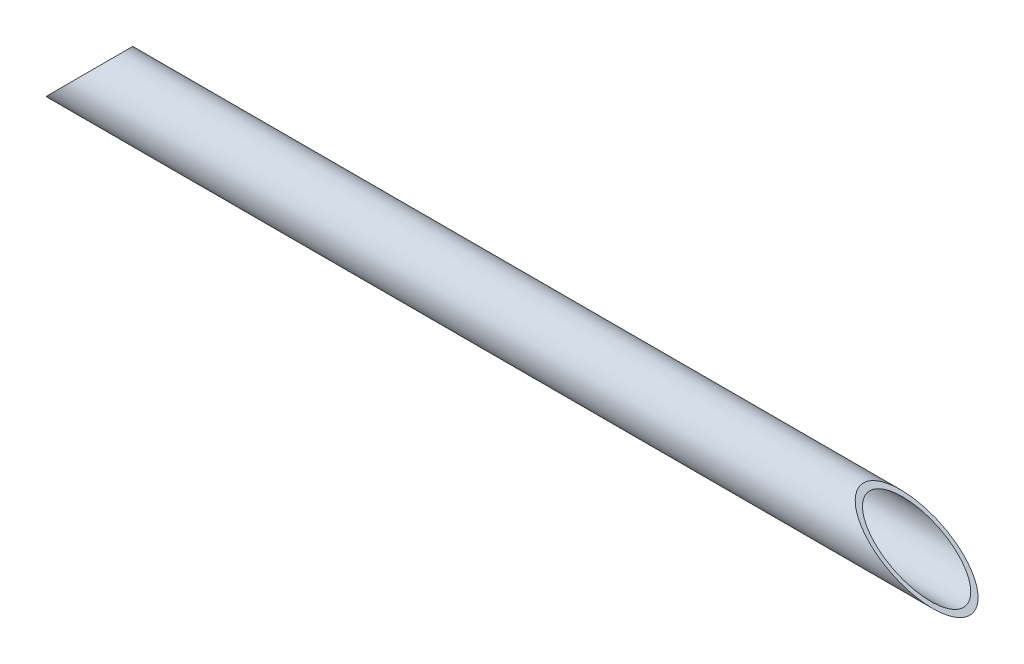
ISO-10303-21;
HEADER;
FILE_DESCRIPTION(('STEP AP214'),'2;1');
FILE_NAME('part.step','',(''),(''),'','','');
FILE_SCHEMA(('AUTOMOTIVE_DESIGN { 1 0 10303 214 1 1 1 1 }'));
ENDSEC;
DATA;
#1=APPLICATION_CONTEXT('core data for automotive mechanical design processes');
#2=APPLICATION_PROTOCOL_DEFINITION('international standard','automotive_design',2000,#1);
#3=PRODUCT_CONTEXT('',#1,'mechanical');
#4=PRODUCT('Part','Part','',(#3));
#5=PRODUCT_RELATED_PRODUCT_CATEGORY('part','',(#4));
#6=PRODUCT_DEFINITION_FORMATION('','',#4);
#7=PRODUCT_DEFINITION_CONTEXT('part definition',#1,'design');
#8=PRODUCT_DEFINITION('design','',#6,#7);
#9=PRODUCT_DEFINITION_SHAPE('','',#8);
#10=(LENGTH_UNIT() NAMED_UNIT(*) SI_UNIT(.MILLI.,.METRE.));
#11=(NAMED_UNIT(*) PLANE_ANGLE_UNIT() SI_UNIT($,.RADIAN.));
#12=(NAMED_UNIT(*) SI_UNIT($,.STERADIAN.) SOLID_ANGLE_UNIT());
#13=UNCERTAINTY_MEASURE_WITH_UNIT(LENGTH_MEASURE(1.E-05),#10,'distance_accuracy_value','');
#14=(GEOMETRIC_REPRESENTATION_CONTEXT(3) GLOBAL_UNCERTAINTY_ASSIGNED_CONTEXT((#13)) GLOBAL_UNIT_ASSIGNED_CONTEXT((#10,
#11,#12)) REPRESENTATION_CONTEXT('',''));
#15=CARTESIAN_POINT('',(0.,0.,0.));
#16=DIRECTION('',(0.,0.,1.));
#17=DIRECTION('',(1.,0.,0.));
#18=AXIS2_PLACEMENT_3D('',#15,#16,#17);
#19=CARTESIAN_POINT('',(287.299183666122,105.952873567218,646.395305171886));
#20=DIRECTION('',(0.500000000000001,0.866025403784438,0.));
#21=DIRECTION('',(-0.866025403784438,0.500000000000001,0.));
#22=AXIS2_PLACEMENT_3D('',#19,#20,#21);
#23=PLANE('',#22);
#24=CARTESIAN_POINT('',(470.814943892464,0.,0.));
#25=DIRECTION('',(0.500000000000001,0.866025403784438,0.));
#26=DIRECTION('',(-0.866025403784438,0.500000000000001,0.));
#27=AXIS2_PLACEMENT_3D('',#24,#25,#26);
#28=ELLIPSE('',#27,29.6999999999999,14.85);
#29=CARTESIAN_POINT('',(445.093989400067,14.85,0.));
#30=VERTEX_POINT('',#29);
#31=EDGE_CURVE('E60',#30,#30,#28,.T.);
#32=ORIENTED_EDGE('',*,*,#31,.F.);
#33=EDGE_LOOP('',(#32));
#34=FACE_BOUND('',#33,.T.);
#35=CARTESIAN_POINT('',(470.814943892464,0.,0.));
#36=DIRECTION('',(0.500000000000001,0.866025403784438,0.));
#37=DIRECTION('',(-0.866025403784438,0.500000000000001,0.));
#38=AXIS2_PLACEMENT_3D('',#35,#36,#37);
#39=ELLIPSE('',#38,33.6999999999999,16.85);
#40=CARTESIAN_POINT('',(441.629887784929,16.85,0.));
#41=VERTEX_POINT('',#40);
#42=EDGE_CURVE('E64',#41,#41,#39,.T.);
#43=ORIENTED_EDGE('',*,*,#42,.T.);
#44=EDGE_LOOP('',(#43));
#45=FACE_BOUND('',#44,.T.);
#46=ADVANCED_FACE('F56',(#34,#45),#23,.T.);
#47=CARTESIAN_POINT('',(500.,0.,0.));
#48=DIRECTION('',(-1.,0.,0.));
#49=DIRECTION('',(0.,0.,1.));
#50=AXIS2_PLACEMENT_3D('',#47,#48,#49);
#51=CYLINDRICAL_SURFACE('',#50,16.85);
#52=ORIENTED_EDGE('',*,*,#42,.F.);
#53=EDGE_LOOP('',(#52));
#54=FACE_BOUND('',#53,.T.);
#55=CARTESIAN_POINT('',(16.8499999999999,0.,0.));
#56=DIRECTION('',(-0.707106781186549,0.707106781186546,0.));
#57=DIRECTION('',(-0.707106781186546,-0.707106781186549,0.));
#58=AXIS2_PLACEMENT_3D('',#55,#56,#57);
#59=ELLIPSE('',#58,23.8294985259866,16.85);
#60=CARTESIAN_POINT('',(0.,-16.85,0.));
#61=VERTEX_POINT('',#60);
#62=EDGE_CURVE('E13',#61,#61,#59,.T.);
#63=ORIENTED_EDGE('',*,*,#62,.F.);
#64=EDGE_LOOP('',(#63));
#65=FACE_BOUND('',#64,.T.);
#66=ADVANCED_FACE('F80',(#54,#65),#51,.T.);
#67=CARTESIAN_POINT('',(0.,-16.85,646.395305171886));
#68=DIRECTION('',(-0.707106781186549,0.707106781186546,0.));
#69=DIRECTION('',(-0.707106781186546,-0.707106781186549,0.));
#70=AXIS2_PLACEMENT_3D('',#67,#68,#69);
#71=PLANE('',#70);
#72=CARTESIAN_POINT('',(16.8499999999999,0.,0.));
#73=DIRECTION('',(-0.707106781186549,0.707106781186546,0.));
#74=DIRECTION('',(-0.707106781186546,-0.707106781186549,0.));
#75=AXIS2_PLACEMENT_3D('',#72,#73,#74);
#76=ELLIPSE('',#75,21.0010714012404,14.85);
#77=CARTESIAN_POINT('',(1.99999999999998,-14.85,0.));
#78=VERTEX_POINT('',#77);
#79=EDGE_CURVE('E70',#78,#78,#76,.T.);
#80=ORIENTED_EDGE('',*,*,#79,.F.);
#81=EDGE_LOOP('',(#80));
#82=FACE_BOUND('',#81,.T.);
#83=ORIENTED_EDGE('',*,*,#62,.T.);
#84=EDGE_LOOP('',(#83));
#85=FACE_BOUND('',#84,.T.);
#86=ADVANCED_FACE('F86',(#82,#85),#71,.T.);
#87=CARTESIAN_POINT('',(500.,0.,0.));
#88=DIRECTION('',(-1.,0.,0.));
#89=DIRECTION('',(0.,0.,1.));
#90=AXIS2_PLACEMENT_3D('',#87,#88,#89);
#91=CYLINDRICAL_SURFACE('',#90,14.85);
#92=ORIENTED_EDGE('',*,*,#31,.T.);
#93=EDGE_LOOP('',(#92));
#94=FACE_BOUND('',#93,.T.);
#95=ORIENTED_EDGE('',*,*,#79,.T.);
#96=EDGE_LOOP('',(#95));
#97=FACE_BOUND('',#96,.T.);
#98=ADVANCED_FACE('F58',(#94,#97),#91,.F.);
#99=CLOSED_SHELL('',(#46,#66,#86,#98));
#100=MANIFOLD_SOLID_BREP('B2',#99);
#101=ADVANCED_BREP_SHAPE_REPRESENTATION('',(#18,#100),#14);
#102=SHAPE_DEFINITION_REPRESENTATION(#9,#101);
ENDSEC;
END-ISO-10303-21;
